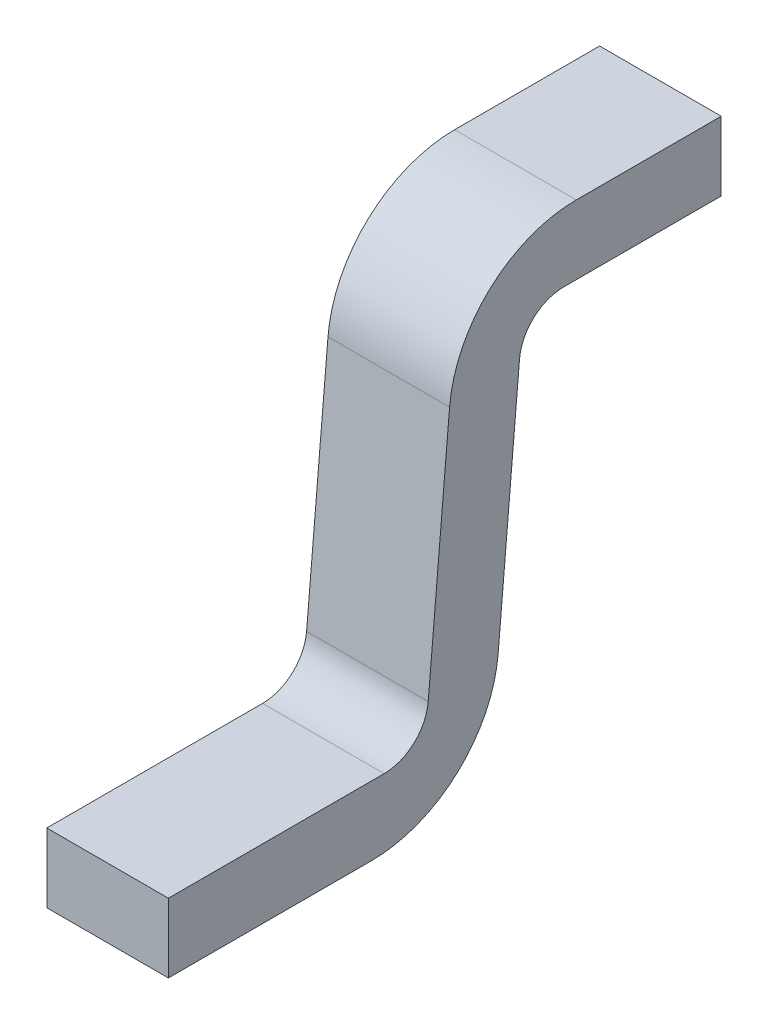
ISO-10303-21;
HEADER;
FILE_DESCRIPTION(('STEP AP214'),'2;1');
FILE_NAME('part.step','',(''),(''),'','','');
FILE_SCHEMA(('AUTOMOTIVE_DESIGN { 1 0 10303 214 1 1 1 1 }'));
ENDSEC;
DATA;
#1=APPLICATION_CONTEXT('core data for automotive mechanical design processes');
#2=APPLICATION_PROTOCOL_DEFINITION('international standard','automotive_design',2000,#1);
#3=PRODUCT_CONTEXT('',#1,'mechanical');
#4=PRODUCT('Part','Part','',(#3));
#5=PRODUCT_RELATED_PRODUCT_CATEGORY('part','',(#4));
#6=PRODUCT_DEFINITION_FORMATION('','',#4);
#7=PRODUCT_DEFINITION_CONTEXT('part definition',#1,'design');
#8=PRODUCT_DEFINITION('design','',#6,#7);
#9=PRODUCT_DEFINITION_SHAPE('','',#8);
#10=(LENGTH_UNIT() NAMED_UNIT(*) SI_UNIT(.MILLI.,.METRE.));
#11=(NAMED_UNIT(*) PLANE_ANGLE_UNIT() SI_UNIT($,.RADIAN.));
#12=(NAMED_UNIT(*) SI_UNIT($,.STERADIAN.) SOLID_ANGLE_UNIT());
#13=UNCERTAINTY_MEASURE_WITH_UNIT(LENGTH_MEASURE(1.E-05),#10,'distance_accuracy_value','');
#14=(GEOMETRIC_REPRESENTATION_CONTEXT(3) GLOBAL_UNCERTAINTY_ASSIGNED_CONTEXT((#13)) GLOBAL_UNIT_ASSIGNED_CONTEXT((#10,
#11,#12)) REPRESENTATION_CONTEXT('',''));
#15=CARTESIAN_POINT('',(0.,0.,0.));
#16=DIRECTION('',(0.,0.,1.));
#17=DIRECTION('',(1.,0.,0.));
#18=AXIS2_PLACEMENT_3D('',#15,#16,#17);
#19=CARTESIAN_POINT('',(0.11,0.,0.));
#20=DIRECTION('',(1.,0.,0.));
#21=DIRECTION('',(0.,0.,-1.));
#22=AXIS2_PLACEMENT_3D('',#19,#20,#21);
#23=PLANE('',#22);
#24=CARTESIAN_POINT('',(0.11,0.37,-0.1377718884466));
#25=DIRECTION('',(-1.,0.,0.));
#26=DIRECTION('',(0.,0.,1.));
#27=AXIS2_PLACEMENT_3D('',#24,#25,#26);
#28=CIRCLE('',#27,0.23);
#29=CARTESIAN_POINT('',(0.11,0.390045820831982,0.0913528921144862));
#30=VERTEX_POINT('',#29);
#31=CARTESIAN_POINT('',(0.11,0.6,-0.1377718884466));
#32=VERTEX_POINT('',#31);
#33=EDGE_CURVE('E195',#30,#32,#28,.T.);
#34=ORIENTED_EDGE('',*,*,#33,.F.);
#35=DIRECTION('',(0.,-0.996194698091745,0.0871557427476639));
#36=VECTOR('',#35,1.);
#37=CARTESIAN_POINT('',(0.11,0.01089446784346,0.1245243372615));
#38=LINE('',#37,#36);
#39=CARTESIAN_POINT('',(0.11,-0.0519724594198096,0.130024480707753));
#40=VERTEX_POINT('',#39);
#41=EDGE_CURVE('E192',#40,#30,#38,.F.);
#42=ORIENTED_EDGE('',*,*,#41,.F.);
#43=CARTESIAN_POINT('',(0.11,-0.045,0.2097200565551));
#44=DIRECTION('',(1.,0.,0.));
#45=DIRECTION('',(0.,0.,-1.));
#46=AXIS2_PLACEMENT_3D('',#43,#44,#45);
#47=CIRCLE('',#46,0.08);
#48=CARTESIAN_POINT('',(0.11,-0.125,0.2097200565551));
#49=VERTEX_POINT('',#48);
#50=EDGE_CURVE('E189',#40,#49,#47,.F.);
#51=ORIENTED_EDGE('',*,*,#50,.T.);
#52=DIRECTION('',(0.,0.,1.));
#53=VECTOR('',#52,1.);
#54=CARTESIAN_POINT('',(0.11,-0.125,0.1364135626337));
#55=LINE('',#54,#53);
#56=CARTESIAN_POINT('',(0.11,-0.125,0.6));
#57=VERTEX_POINT('',#56);
#58=EDGE_CURVE('E185',#57,#49,#55,.F.);
#59=ORIENTED_EDGE('',*,*,#58,.F.);
#60=DIRECTION('',(0.,1.,0.));
#61=VECTOR('',#60,1.);
#62=CARTESIAN_POINT('',(0.11,-0.125,0.6));
#63=LINE('',#62,#61);
#64=CARTESIAN_POINT('',(0.11,-0.25,0.6));
#65=VERTEX_POINT('',#64);
#66=EDGE_CURVE('E125',#65,#57,#63,.T.);
#67=ORIENTED_EDGE('',*,*,#66,.F.);
#68=DIRECTION('',(0.,0.,-1.));
#69=VECTOR('',#68,1.);
#70=CARTESIAN_POINT('',(0.11,-0.25,0.6));
#71=LINE('',#70,#69);
#72=CARTESIAN_POINT('',(0.11,-0.25,0.2326283359055));
#73=VERTEX_POINT('',#72);
#74=EDGE_CURVE('E129',#73,#65,#71,.F.);
#75=ORIENTED_EDGE('',*,*,#74,.F.);
#76=CARTESIAN_POINT('',(0.11,-0.02,0.2326283359055));
#77=DIRECTION('',(-1.,0.,0.));
#78=DIRECTION('',(0.,0.,1.));
#79=AXIS2_PLACEMENT_3D('',#76,#77,#78);
#80=CIRCLE('',#79,0.23);
#81=CARTESIAN_POINT('',(0.11,-0.0400458208319614,0.00350355534439158));
#82=VERTEX_POINT('',#81);
#83=EDGE_CURVE('E173',#82,#73,#80,.T.);
#84=ORIENTED_EDGE('',*,*,#83,.F.);
#85=DIRECTION('',(0.,0.996194698091745,-0.0871557427476639));
#86=VECTOR('',#85,1.);
#87=CARTESIAN_POINT('',(0.11,-0.25,0.02187216588148));
#88=LINE('',#87,#86);
#89=CARTESIAN_POINT('',(0.11,0.401972459419806,-0.0351680332488661));
#90=VERTEX_POINT('',#89);
#91=EDGE_CURVE('E89',#90,#82,#88,.F.);
#92=ORIENTED_EDGE('',*,*,#91,.F.);
#93=CARTESIAN_POINT('',(0.11,0.395,-0.1148636090962));
#94=DIRECTION('',(1.,0.,0.));
#95=DIRECTION('',(0.,0.,-1.));
#96=AXIS2_PLACEMENT_3D('',#93,#94,#95);
#97=CIRCLE('',#96,0.08);
#98=CARTESIAN_POINT('',(0.11,0.475,-0.1148636090962));
#99=VERTEX_POINT('',#98);
#100=EDGE_CURVE('E19',#90,#99,#97,.F.);
#101=ORIENTED_EDGE('',*,*,#100,.T.);
#102=DIRECTION('',(0.,0.,-1.));
#103=VECTOR('',#102,1.);
#104=CARTESIAN_POINT('',(0.11,0.475,-0.04155711517481));
#105=LINE('',#104,#103);
#106=CARTESIAN_POINT('',(0.11,0.475,-0.4));
#107=VERTEX_POINT('',#106);
#108=EDGE_CURVE('E95',#107,#99,#105,.F.);
#109=ORIENTED_EDGE('',*,*,#108,.F.);
#110=DIRECTION('',(0.,1.,0.));
#111=VECTOR('',#110,1.);
#112=CARTESIAN_POINT('',(0.11,0.475,-0.4));
#113=LINE('',#112,#111);
#114=CARTESIAN_POINT('',(0.11,0.6,-0.4));
#115=VERTEX_POINT('',#114);
#116=EDGE_CURVE('E101',#115,#107,#113,.F.);
#117=ORIENTED_EDGE('',*,*,#116,.F.);
#118=DIRECTION('',(0.,0.,1.));
#119=VECTOR('',#118,1.);
#120=CARTESIAN_POINT('',(0.11,0.6,-0.4));
#121=LINE('',#120,#119);
#122=EDGE_CURVE('E107',#32,#115,#121,.F.);
#123=ORIENTED_EDGE('',*,*,#122,.F.);
#124=EDGE_LOOP('',(#34,#42,#51,#59,#67,#75,#84,#92,#101,#109,#117,#123));
#125=FACE_BOUND('',#124,.T.);
#126=ADVANCED_FACE('F16',(#125),#23,.T.);
#127=CARTESIAN_POINT('',(-0.11,-0.25,0.02187216588148));
#128=DIRECTION('',(0.,-0.0871557427476639,-0.996194698091745));
#129=DIRECTION('',(0.,0.996194698091745,-0.0871557427476639));
#130=AXIS2_PLACEMENT_3D('',#127,#128,#129);
#131=PLANE('',#130);
#132=DIRECTION('',(1.,0.,0.));
#133=VECTOR('',#132,1.);
#134=CARTESIAN_POINT('',(-0.11,0.401972459419801,-0.0351680332488593));
#135=LINE('',#134,#133);
#136=CARTESIAN_POINT('',(-0.11,0.401972459419807,-0.0351680332488652));
#137=VERTEX_POINT('',#136);
#138=EDGE_CURVE('E210',#137,#90,#135,.T.);
#139=ORIENTED_EDGE('',*,*,#138,.T.);
#140=ORIENTED_EDGE('',*,*,#91,.T.);
#141=DIRECTION('',(-1.,0.,0.));
#142=VECTOR('',#141,1.);
#143=CARTESIAN_POINT('',(-0.11,-0.040045820831959,0.00350355534439829));
#144=LINE('',#143,#142);
#145=CARTESIAN_POINT('',(-0.11,-0.0400458208319615,0.00350355534439284));
#146=VERTEX_POINT('',#145);
#147=EDGE_CURVE('E171',#146,#82,#144,.F.);
#148=ORIENTED_EDGE('',*,*,#147,.F.);
#149=DIRECTION('',(0.,0.996194698091745,-0.0871557427476653));
#150=VECTOR('',#149,1.);
#151=CARTESIAN_POINT('',(-0.11,-0.04004582083196,0.003503555344387));
#152=LINE('',#151,#150);
#153=EDGE_CURVE('E168',#146,#137,#152,.T.);
#154=ORIENTED_EDGE('',*,*,#153,.T.);
#155=EDGE_LOOP('',(#139,#140,#148,#154));
#156=FACE_BOUND('',#155,.T.);
#157=ADVANCED_FACE('F256',(#156),#131,.T.);
#158=CARTESIAN_POINT('',(-0.11,0.395,-0.1148636090962));
#159=DIRECTION('',(1.,0.,0.));
#160=DIRECTION('',(0.,0.,-1.));
#161=AXIS2_PLACEMENT_3D('',#158,#159,#160);
#162=CYLINDRICAL_SURFACE('',#161,0.08);
#163=ORIENTED_EDGE('',*,*,#138,.F.);
#164=CARTESIAN_POINT('',(-0.11,0.395,-0.1148636090962));
#165=DIRECTION('',(1.,0.,0.));
#166=DIRECTION('',(0.,0.,-1.));
#167=AXIS2_PLACEMENT_3D('',#164,#165,#166);
#168=CIRCLE('',#167,0.08);
#169=CARTESIAN_POINT('',(-0.11,0.475,-0.1148636090962));
#170=VERTEX_POINT('',#169);
#171=EDGE_CURVE('E165',#137,#170,#168,.F.);
#172=ORIENTED_EDGE('',*,*,#171,.T.);
#173=DIRECTION('',(1.,0.,0.));
#174=VECTOR('',#173,1.);
#175=CARTESIAN_POINT('',(-0.11,0.475,-0.1148636090962));
#176=LINE('',#175,#174);
#177=EDGE_CURVE('E208',#99,#170,#176,.F.);
#178=ORIENTED_EDGE('',*,*,#177,.F.);
#179=ORIENTED_EDGE('',*,*,#100,.F.);
#180=EDGE_LOOP('',(#163,#172,#178,#179));
#181=FACE_BOUND('',#180,.T.);
#182=ADVANCED_FACE('F254',(#181),#162,.F.);
#183=CARTESIAN_POINT('',(-0.11,0.475,-0.04155711517481));
#184=DIRECTION('',(0.,-1.,0.));
#185=DIRECTION('',(0.,0.,-1.));
#186=AXIS2_PLACEMENT_3D('',#183,#184,#185);
#187=PLANE('',#186);
#188=ORIENTED_EDGE('',*,*,#177,.T.);
#189=DIRECTION('',(0.,0.,-1.));
#190=VECTOR('',#189,1.);
#191=CARTESIAN_POINT('',(-0.11,0.475,0.));
#192=LINE('',#191,#190);
#193=CARTESIAN_POINT('',(-0.11,0.475,-0.4));
#194=VERTEX_POINT('',#193);
#195=EDGE_CURVE('E162',#170,#194,#192,.T.);
#196=ORIENTED_EDGE('',*,*,#195,.T.);
#197=DIRECTION('',(-1.,0.,0.));
#198=VECTOR('',#197,1.);
#199=CARTESIAN_POINT('',(-0.11,0.475,-0.4));
#200=LINE('',#199,#198);
#201=EDGE_CURVE('E204',#107,#194,#200,.T.);
#202=ORIENTED_EDGE('',*,*,#201,.F.);
#203=ORIENTED_EDGE('',*,*,#108,.T.);
#204=EDGE_LOOP('',(#188,#196,#202,#203));
#205=FACE_BOUND('',#204,.T.);
#206=ADVANCED_FACE('F250',(#205),#187,.T.);
#207=CARTESIAN_POINT('',(-0.11,0.475,-0.4));
#208=DIRECTION('',(0.,0.,-1.));
#209=DIRECTION('',(-1.,0.,0.));
#210=AXIS2_PLACEMENT_3D('',#207,#208,#209);
#211=PLANE('',#210);
#212=ORIENTED_EDGE('',*,*,#201,.T.);
#213=DIRECTION('',(0.,1.,0.));
#214=VECTOR('',#213,1.);
#215=CARTESIAN_POINT('',(-0.11,0.,-0.4));
#216=LINE('',#215,#214);
#217=CARTESIAN_POINT('',(-0.11,0.6,-0.4));
#218=VERTEX_POINT('',#217);
#219=EDGE_CURVE('E159',#194,#218,#216,.T.);
#220=ORIENTED_EDGE('',*,*,#219,.T.);
#221=DIRECTION('',(1.,0.,0.));
#222=VECTOR('',#221,1.);
#223=CARTESIAN_POINT('',(-0.11,0.6,-0.4));
#224=LINE('',#223,#222);
#225=EDGE_CURVE('E196',#115,#218,#224,.F.);
#226=ORIENTED_EDGE('',*,*,#225,.F.);
#227=ORIENTED_EDGE('',*,*,#116,.T.);
#228=EDGE_LOOP('',(#212,#220,#226,#227));
#229=FACE_BOUND('',#228,.T.);
#230=ADVANCED_FACE('F249',(#229),#211,.T.);
#231=CARTESIAN_POINT('',(-0.11,0.6,-0.4));
#232=DIRECTION('',(0.,1.,0.));
#233=DIRECTION('',(0.,0.,1.));
#234=AXIS2_PLACEMENT_3D('',#231,#232,#233);
#235=PLANE('',#234);
#236=ORIENTED_EDGE('',*,*,#225,.T.);
#237=DIRECTION('',(0.,0.,-1.));
#238=VECTOR('',#237,1.);
#239=CARTESIAN_POINT('',(-0.11,0.6,0.));
#240=LINE('',#239,#238);
#241=CARTESIAN_POINT('',(-0.11,0.6,-0.1377718884466));
#242=VERTEX_POINT('',#241);
#243=EDGE_CURVE('E156',#218,#242,#240,.F.);
#244=ORIENTED_EDGE('',*,*,#243,.T.);
#245=DIRECTION('',(-1.,0.,0.));
#246=VECTOR('',#245,1.);
#247=CARTESIAN_POINT('',(-0.11,0.6,-0.1377718884466));
#248=LINE('',#247,#246);
#249=EDGE_CURVE('E193',#32,#242,#248,.T.);
#250=ORIENTED_EDGE('',*,*,#249,.F.);
#251=ORIENTED_EDGE('',*,*,#122,.T.);
#252=EDGE_LOOP('',(#236,#244,#250,#251));
#253=FACE_BOUND('',#252,.T.);
#254=ADVANCED_FACE('F244',(#253),#235,.T.);
#255=CARTESIAN_POINT('',(-0.11,0.37,-0.1377718884466));
#256=DIRECTION('',(-1.,0.,0.));
#257=DIRECTION('',(0.,0.,1.));
#258=AXIS2_PLACEMENT_3D('',#255,#256,#257);
#259=CYLINDRICAL_SURFACE('',#258,0.23);
#260=CARTESIAN_POINT('',(-0.11,0.37,-0.1377718884466));
#261=DIRECTION('',(-1.,0.,0.));
#262=DIRECTION('',(0.,0.,1.));
#263=AXIS2_PLACEMENT_3D('',#260,#261,#262);
#264=CIRCLE('',#263,0.23);
#265=CARTESIAN_POINT('',(-0.11,0.390045820831975,0.0913528921144744));
#266=VERTEX_POINT('',#265);
#267=EDGE_CURVE('E155',#242,#266,#264,.F.);
#268=ORIENTED_EDGE('',*,*,#267,.T.);
#269=DIRECTION('',(1.,0.,0.));
#270=VECTOR('',#269,1.);
#271=CARTESIAN_POINT('',(-0.11,0.390045820832002,0.0913528921144844));
#272=LINE('',#271,#270);
#273=EDGE_CURVE('E190',#30,#266,#272,.F.);
#274=ORIENTED_EDGE('',*,*,#273,.F.);
#275=ORIENTED_EDGE('',*,*,#33,.T.);
#276=ORIENTED_EDGE('',*,*,#249,.T.);
#277=EDGE_LOOP('',(#268,#274,#275,#276));
#278=FACE_BOUND('',#277,.T.);
#279=ADVANCED_FACE('F242',(#278),#259,.T.);
#280=CARTESIAN_POINT('',(-0.11,0.01089446784346,0.1245243372615));
#281=DIRECTION('',(0.,0.0871557427476639,0.996194698091745));
#282=DIRECTION('',(0.,-0.996194698091745,0.0871557427476639));
#283=AXIS2_PLACEMENT_3D('',#280,#281,#282);
#284=PLANE('',#283);
#285=ORIENTED_EDGE('',*,*,#273,.T.);
#286=DIRECTION('',(0.,-0.996194698091749,0.0871557427476175));
#287=VECTOR('',#286,1.);
#288=CARTESIAN_POINT('',(-0.11,0.390045820832,0.09135289211446));
#289=LINE('',#288,#287);
#290=CARTESIAN_POINT('',(-0.11,-0.0519724594198097,0.13002448070773));
#291=VERTEX_POINT('',#290);
#292=EDGE_CURVE('E145',#266,#291,#289,.T.);
#293=ORIENTED_EDGE('',*,*,#292,.T.);
#294=DIRECTION('',(1.,0.,0.));
#295=VECTOR('',#294,1.);
#296=CARTESIAN_POINT('',(-0.11,-0.0519724594198048,0.13002448070776));
#297=LINE('',#296,#295);
#298=EDGE_CURVE('E186',#291,#40,#297,.T.);
#299=ORIENTED_EDGE('',*,*,#298,.T.);
#300=ORIENTED_EDGE('',*,*,#41,.T.);
#301=EDGE_LOOP('',(#285,#293,#299,#300));
#302=FACE_BOUND('',#301,.T.);
#303=ADVANCED_FACE('F265',(#302),#284,.T.);
#304=CARTESIAN_POINT('',(-0.11,-0.045,0.2097200565551));
#305=DIRECTION('',(1.,0.,0.));
#306=DIRECTION('',(0.,0.,-1.));
#307=AXIS2_PLACEMENT_3D('',#304,#305,#306);
#308=CYLINDRICAL_SURFACE('',#307,0.08);
#309=ORIENTED_EDGE('',*,*,#298,.F.);
#310=CARTESIAN_POINT('',(-0.11,-0.045,0.2097200565551));
#311=DIRECTION('',(1.,0.,0.));
#312=DIRECTION('',(0.,0.,-1.));
#313=AXIS2_PLACEMENT_3D('',#310,#311,#312);
#314=CIRCLE('',#313,0.08);
#315=CARTESIAN_POINT('',(-0.11,-0.125,0.2097200565551));
#316=VERTEX_POINT('',#315);
#317=EDGE_CURVE('E143',#291,#316,#314,.F.);
#318=ORIENTED_EDGE('',*,*,#317,.T.);
#319=DIRECTION('',(1.,0.,0.));
#320=VECTOR('',#319,1.);
#321=CARTESIAN_POINT('',(-0.11,-0.125,0.2097200565551));
#322=LINE('',#321,#320);
#323=EDGE_CURVE('E142',#49,#316,#322,.F.);
#324=ORIENTED_EDGE('',*,*,#323,.F.);
#325=ORIENTED_EDGE('',*,*,#50,.F.);
#326=EDGE_LOOP('',(#309,#318,#324,#325));
#327=FACE_BOUND('',#326,.T.);
#328=ADVANCED_FACE('F263',(#327),#308,.F.);
#329=CARTESIAN_POINT('',(-0.11,-0.125,0.1364135626337));
#330=DIRECTION('',(0.,1.,0.));
#331=DIRECTION('',(0.,0.,1.));
#332=AXIS2_PLACEMENT_3D('',#329,#330,#331);
#333=PLANE('',#332);
#334=ORIENTED_EDGE('',*,*,#323,.T.);
#335=DIRECTION('',(0.,0.,-1.));
#336=VECTOR('',#335,1.);
#337=CARTESIAN_POINT('',(-0.11,-0.125,0.));
#338=LINE('',#337,#336);
#339=CARTESIAN_POINT('',(-0.11,-0.125,0.6));
#340=VERTEX_POINT('',#339);
#341=EDGE_CURVE('E136',#316,#340,#338,.F.);
#342=ORIENTED_EDGE('',*,*,#341,.T.);
#343=DIRECTION('',(1.,0.,0.));
#344=VECTOR('',#343,1.);
#345=CARTESIAN_POINT('',(-0.11,-0.125,0.6));
#346=LINE('',#345,#344);
#347=EDGE_CURVE('E119',#57,#340,#346,.F.);
#348=ORIENTED_EDGE('',*,*,#347,.F.);
#349=ORIENTED_EDGE('',*,*,#58,.T.);
#350=EDGE_LOOP('',(#334,#342,#348,#349));
#351=FACE_BOUND('',#350,.T.);
#352=ADVANCED_FACE('F140',(#351),#333,.T.);
#353=CARTESIAN_POINT('',(-0.11,-0.125,0.6));
#354=DIRECTION('',(0.,0.,1.));
#355=DIRECTION('',(1.,0.,0.));
#356=AXIS2_PLACEMENT_3D('',#353,#354,#355);
#357=PLANE('',#356);
#358=ORIENTED_EDGE('',*,*,#347,.T.);
#359=DIRECTION('',(0.,1.,0.));
#360=VECTOR('',#359,1.);
#361=CARTESIAN_POINT('',(-0.11,0.,0.6));
#362=LINE('',#361,#360);
#363=CARTESIAN_POINT('',(-0.11,-0.25,0.6));
#364=VERTEX_POINT('',#363);
#365=EDGE_CURVE('E123',#340,#364,#362,.F.);
#366=ORIENTED_EDGE('',*,*,#365,.T.);
#367=DIRECTION('',(1.,0.,0.));
#368=VECTOR('',#367,1.);
#369=CARTESIAN_POINT('',(-0.11,-0.25,0.6));
#370=LINE('',#369,#368);
#371=EDGE_CURVE('E176',#65,#364,#370,.F.);
#372=ORIENTED_EDGE('',*,*,#371,.F.);
#373=ORIENTED_EDGE('',*,*,#66,.T.);
#374=EDGE_LOOP('',(#358,#366,#372,#373));
#375=FACE_BOUND('',#374,.T.);
#376=ADVANCED_FACE('F121',(#375),#357,.T.);
#377=CARTESIAN_POINT('',(-0.11,-0.25,0.6));
#378=DIRECTION('',(0.,-1.,0.));
#379=DIRECTION('',(0.,0.,-1.));
#380=AXIS2_PLACEMENT_3D('',#377,#378,#379);
#381=PLANE('',#380);
#382=ORIENTED_EDGE('',*,*,#371,.T.);
#383=DIRECTION('',(0.,0.,-1.));
#384=VECTOR('',#383,1.);
#385=CARTESIAN_POINT('',(-0.11,-0.25,0.));
#386=LINE('',#385,#384);
#387=CARTESIAN_POINT('',(-0.11,-0.25,0.2326283359055));
#388=VERTEX_POINT('',#387);
#389=EDGE_CURVE('E25',#364,#388,#386,.T.);
#390=ORIENTED_EDGE('',*,*,#389,.T.);
#391=DIRECTION('',(-1.,0.,0.));
#392=VECTOR('',#391,1.);
#393=CARTESIAN_POINT('',(-0.11,-0.25,0.2326283359055));
#394=LINE('',#393,#392);
#395=EDGE_CURVE('E33',#73,#388,#394,.T.);
#396=ORIENTED_EDGE('',*,*,#395,.F.);
#397=ORIENTED_EDGE('',*,*,#74,.T.);
#398=EDGE_LOOP('',(#382,#390,#396,#397));
#399=FACE_BOUND('',#398,.T.);
#400=ADVANCED_FACE('F259',(#399),#381,.T.);
#401=CARTESIAN_POINT('',(-0.11,-0.02,0.2326283359055));
#402=DIRECTION('',(-1.,0.,0.));
#403=DIRECTION('',(0.,0.,1.));
#404=AXIS2_PLACEMENT_3D('',#401,#402,#403);
#405=CYLINDRICAL_SURFACE('',#404,0.23);
#406=CARTESIAN_POINT('',(-0.11,-0.02,0.2326283359055));
#407=DIRECTION('',(-1.,0.,0.));
#408=DIRECTION('',(0.,0.,1.));
#409=AXIS2_PLACEMENT_3D('',#406,#407,#408);
#410=CIRCLE('',#409,0.23);
#411=EDGE_CURVE('E10',#388,#146,#410,.F.);
#412=ORIENTED_EDGE('',*,*,#411,.T.);
#413=ORIENTED_EDGE('',*,*,#147,.T.);
#414=ORIENTED_EDGE('',*,*,#83,.T.);
#415=ORIENTED_EDGE('',*,*,#395,.T.);
#416=EDGE_LOOP('',(#412,#413,#414,#415));
#417=FACE_BOUND('',#416,.T.);
#418=ADVANCED_FACE('F276',(#417),#405,.T.);
#419=CARTESIAN_POINT('',(-0.11,0.,0.));
#420=DIRECTION('',(1.,0.,0.));
#421=DIRECTION('',(0.,0.,-1.));
#422=AXIS2_PLACEMENT_3D('',#419,#420,#421);
#423=PLANE('',#422);
#424=ORIENTED_EDGE('',*,*,#389,.F.);
#425=ORIENTED_EDGE('',*,*,#365,.F.);
#426=ORIENTED_EDGE('',*,*,#341,.F.);
#427=ORIENTED_EDGE('',*,*,#317,.F.);
#428=ORIENTED_EDGE('',*,*,#292,.F.);
#429=ORIENTED_EDGE('',*,*,#267,.F.);
#430=ORIENTED_EDGE('',*,*,#243,.F.);
#431=ORIENTED_EDGE('',*,*,#219,.F.);
#432=ORIENTED_EDGE('',*,*,#195,.F.);
#433=ORIENTED_EDGE('',*,*,#171,.F.);
#434=ORIENTED_EDGE('',*,*,#153,.F.);
#435=ORIENTED_EDGE('',*,*,#411,.F.);
#436=EDGE_LOOP('',(#424,#425,#426,#427,#428,#429,#430,#431,#432,#433,#434,#435));
#437=FACE_BOUND('',#436,.T.);
#438=ADVANCED_FACE('F134',(#437),#423,.F.);
#439=CLOSED_SHELL('',(#126,#157,#182,#206,#230,#254,#279,#303,#328,#352,#376,#400,#418,#438));
#440=MANIFOLD_SOLID_BREP('B1',#439);
#441=ADVANCED_BREP_SHAPE_REPRESENTATION('',(#18,#440),#14);
#442=SHAPE_DEFINITION_REPRESENTATION(#9,#441);
ENDSEC;
END-ISO-10303-21;
